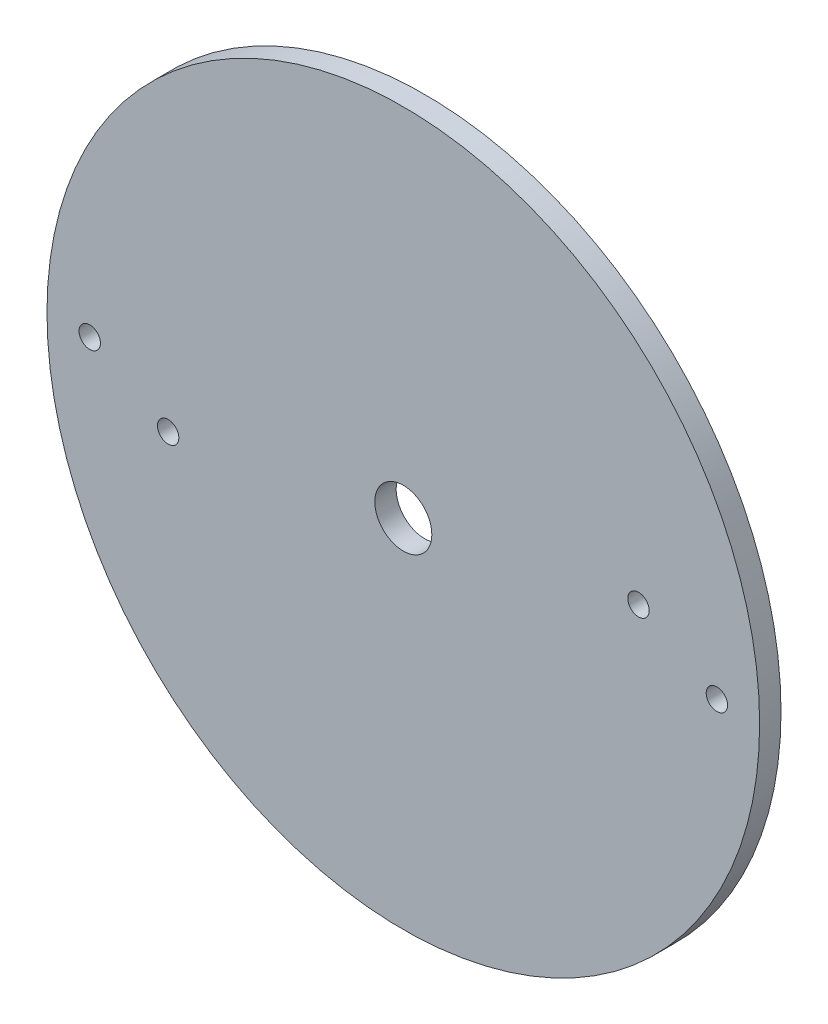
ISO-10303-21;
HEADER;
FILE_DESCRIPTION(('STEP AP214'),'2;1');
FILE_NAME('part.step','',(''),(''),'','','');
FILE_SCHEMA(('AUTOMOTIVE_DESIGN { 1 0 10303 214 1 1 1 1 }'));
ENDSEC;
DATA;
#1=APPLICATION_CONTEXT('core data for automotive mechanical design processes');
#2=APPLICATION_PROTOCOL_DEFINITION('international standard','automotive_design',2000,#1);
#3=PRODUCT_CONTEXT('',#1,'mechanical');
#4=PRODUCT('Part','Part','',(#3));
#5=PRODUCT_RELATED_PRODUCT_CATEGORY('part','',(#4));
#6=PRODUCT_DEFINITION_FORMATION('','',#4);
#7=PRODUCT_DEFINITION_CONTEXT('part definition',#1,'design');
#8=PRODUCT_DEFINITION('design','',#6,#7);
#9=PRODUCT_DEFINITION_SHAPE('','',#8);
#10=(LENGTH_UNIT() NAMED_UNIT(*) SI_UNIT(.MILLI.,.METRE.));
#11=(NAMED_UNIT(*) PLANE_ANGLE_UNIT() SI_UNIT($,.RADIAN.));
#12=(NAMED_UNIT(*) SI_UNIT($,.STERADIAN.) SOLID_ANGLE_UNIT());
#13=UNCERTAINTY_MEASURE_WITH_UNIT(LENGTH_MEASURE(1.E-05),#10,'distance_accuracy_value','');
#14=(GEOMETRIC_REPRESENTATION_CONTEXT(3) GLOBAL_UNCERTAINTY_ASSIGNED_CONTEXT((#13)) GLOBAL_UNIT_ASSIGNED_CONTEXT((#10,
#11,#12)) REPRESENTATION_CONTEXT('',''));
#15=CARTESIAN_POINT('',(0.,0.,0.));
#16=DIRECTION('',(0.,0.,1.));
#17=DIRECTION('',(1.,0.,0.));
#18=AXIS2_PLACEMENT_3D('',#15,#16,#17);
#19=CARTESIAN_POINT('',(0.,0.,3.));
#20=DIRECTION('',(0.,0.,-1.));
#21=DIRECTION('',(-1.,0.,0.));
#22=AXIS2_PLACEMENT_3D('',#19,#20,#21);
#23=CYLINDRICAL_SURFACE('',#22,50.);
#24=CARTESIAN_POINT('',(0.,0.,3.));
#25=DIRECTION('',(0.,0.,1.));
#26=DIRECTION('',(1.,0.,0.));
#27=AXIS2_PLACEMENT_3D('',#24,#25,#26);
#28=CIRCLE('',#27,50.);
#29=CARTESIAN_POINT('',(50.,0.,3.));
#30=VERTEX_POINT('',#29);
#31=EDGE_CURVE('E11',#30,#30,#28,.T.);
#32=ORIENTED_EDGE('',*,*,#31,.F.);
#33=EDGE_LOOP('',(#32));
#34=FACE_BOUND('',#33,.T.);
#35=CARTESIAN_POINT('',(0.,0.,0.));
#36=DIRECTION('',(0.,0.,1.));
#37=DIRECTION('',(1.,0.,0.));
#38=AXIS2_PLACEMENT_3D('',#35,#36,#37);
#39=CIRCLE('',#38,50.);
#40=CARTESIAN_POINT('',(50.,0.,0.));
#41=VERTEX_POINT('',#40);
#42=EDGE_CURVE('E40',#41,#41,#39,.T.);
#43=ORIENTED_EDGE('',*,*,#42,.T.);
#44=EDGE_LOOP('',(#43));
#45=FACE_BOUND('',#44,.T.);
#46=ADVANCED_FACE('F37',(#34,#45),#23,.T.);
#47=CARTESIAN_POINT('',(0.,0.,3.));
#48=DIRECTION('',(0.,0.,1.));
#49=DIRECTION('',(1.,0.,0.));
#50=AXIS2_PLACEMENT_3D('',#47,#48,#49);
#51=PLANE('',#50);
#52=CARTESIAN_POINT('',(32.9999999999999,6.00000000000049,3.));
#53=DIRECTION('',(0.,0.,1.));
#54=DIRECTION('',(-1.,0.,0.));
#55=AXIS2_PLACEMENT_3D('',#52,#53,#54);
#56=CIRCLE('',#55,1.5);
#57=CARTESIAN_POINT('',(31.4999999999999,6.00000000000047,3.));
#58=VERTEX_POINT('',#57);
#59=EDGE_CURVE('E75',#58,#58,#56,.T.);
#60=ORIENTED_EDGE('',*,*,#59,.F.);
#61=EDGE_LOOP('',(#60));
#62=FACE_BOUND('',#61,.T.);
#63=CARTESIAN_POINT('',(-33.,-6.,3.));
#64=DIRECTION('',(0.,0.,1.));
#65=DIRECTION('',(1.,0.,0.));
#66=AXIS2_PLACEMENT_3D('',#63,#64,#65);
#67=CIRCLE('',#66,1.5);
#68=CARTESIAN_POINT('',(-31.5,-6.,3.));
#69=VERTEX_POINT('',#68);
#70=EDGE_CURVE('E69',#69,#69,#67,.T.);
#71=ORIENTED_EDGE('',*,*,#70,.F.);
#72=EDGE_LOOP('',(#71));
#73=FACE_BOUND('',#72,.T.);
#74=CARTESIAN_POINT('',(44.,6.1988916155264E-13,3.));
#75=DIRECTION('',(0.,0.,1.));
#76=DIRECTION('',(-1.,0.,0.));
#77=AXIS2_PLACEMENT_3D('',#74,#75,#76);
#78=CIRCLE('',#77,1.5);
#79=CARTESIAN_POINT('',(42.5,5.98756576499709E-13,3.));
#80=VERTEX_POINT('',#79);
#81=EDGE_CURVE('E63',#80,#80,#78,.T.);
#82=ORIENTED_EDGE('',*,*,#81,.F.);
#83=EDGE_LOOP('',(#82));
#84=FACE_BOUND('',#83,.T.);
#85=CARTESIAN_POINT('',(-44.,0.,3.));
#86=DIRECTION('',(0.,0.,1.));
#87=DIRECTION('',(1.,0.,0.));
#88=AXIS2_PLACEMENT_3D('',#85,#86,#87);
#89=CIRCLE('',#88,1.5);
#90=CARTESIAN_POINT('',(-42.5,0.,3.));
#91=VERTEX_POINT('',#90);
#92=EDGE_CURVE('E57',#91,#91,#89,.T.);
#93=ORIENTED_EDGE('',*,*,#92,.F.);
#94=EDGE_LOOP('',(#93));
#95=FACE_BOUND('',#94,.T.);
#96=CARTESIAN_POINT('',(0.,0.,3.));
#97=DIRECTION('',(0.,0.,1.));
#98=DIRECTION('',(1.,0.,0.));
#99=AXIS2_PLACEMENT_3D('',#96,#97,#98);
#100=CIRCLE('',#99,4.);
#101=CARTESIAN_POINT('',(4.,0.,3.));
#102=VERTEX_POINT('',#101);
#103=EDGE_CURVE('E51',#102,#102,#100,.T.);
#104=ORIENTED_EDGE('',*,*,#103,.F.);
#105=EDGE_LOOP('',(#104));
#106=FACE_BOUND('',#105,.T.);
#107=ORIENTED_EDGE('',*,*,#31,.T.);
#108=EDGE_LOOP('',(#107));
#109=FACE_BOUND('',#108,.T.);
#110=ADVANCED_FACE('F81',(#62,#73,#84,#95,#106,#109),#51,.T.);
#111=CARTESIAN_POINT('',(0.,0.,0.));
#112=DIRECTION('',(0.,0.,1.));
#113=DIRECTION('',(1.,0.,0.));
#114=AXIS2_PLACEMENT_3D('',#111,#112,#113);
#115=PLANE('',#114);
#116=CARTESIAN_POINT('',(32.9999999999999,6.00000000000049,0.));
#117=DIRECTION('',(0.,0.,1.));
#118=DIRECTION('',(1.,0.,0.));
#119=AXIS2_PLACEMENT_3D('',#116,#117,#118);
#120=CIRCLE('',#119,1.5);
#121=CARTESIAN_POINT('',(34.4999999999999,6.00000000000049,0.));
#122=VERTEX_POINT('',#121);
#123=EDGE_CURVE('E72',#122,#122,#120,.F.);
#124=ORIENTED_EDGE('',*,*,#123,.F.);
#125=EDGE_LOOP('',(#124));
#126=FACE_BOUND('',#125,.T.);
#127=CARTESIAN_POINT('',(-33.,-6.,0.));
#128=DIRECTION('',(0.,0.,1.));
#129=DIRECTION('',(1.,0.,0.));
#130=AXIS2_PLACEMENT_3D('',#127,#128,#129);
#131=CIRCLE('',#130,1.5);
#132=CARTESIAN_POINT('',(-31.5,-6.,0.));
#133=VERTEX_POINT('',#132);
#134=EDGE_CURVE('E66',#133,#133,#131,.F.);
#135=ORIENTED_EDGE('',*,*,#134,.F.);
#136=EDGE_LOOP('',(#135));
#137=FACE_BOUND('',#136,.T.);
#138=CARTESIAN_POINT('',(44.,6.1988916155264E-13,0.));
#139=DIRECTION('',(0.,0.,1.));
#140=DIRECTION('',(1.,0.,0.));
#141=AXIS2_PLACEMENT_3D('',#138,#139,#140);
#142=CIRCLE('',#141,1.5);
#143=CARTESIAN_POINT('',(45.5,6.1988916155264E-13,0.));
#144=VERTEX_POINT('',#143);
#145=EDGE_CURVE('E60',#144,#144,#142,.F.);
#146=ORIENTED_EDGE('',*,*,#145,.F.);
#147=EDGE_LOOP('',(#146));
#148=FACE_BOUND('',#147,.T.);
#149=CARTESIAN_POINT('',(-44.,0.,0.));
#150=DIRECTION('',(0.,0.,1.));
#151=DIRECTION('',(1.,0.,0.));
#152=AXIS2_PLACEMENT_3D('',#149,#150,#151);
#153=CIRCLE('',#152,1.5);
#154=CARTESIAN_POINT('',(-42.5,0.,0.));
#155=VERTEX_POINT('',#154);
#156=EDGE_CURVE('E54',#155,#155,#153,.F.);
#157=ORIENTED_EDGE('',*,*,#156,.F.);
#158=EDGE_LOOP('',(#157));
#159=FACE_BOUND('',#158,.T.);
#160=CARTESIAN_POINT('',(0.,0.,0.));
#161=DIRECTION('',(0.,0.,1.));
#162=DIRECTION('',(1.,0.,0.));
#163=AXIS2_PLACEMENT_3D('',#160,#161,#162);
#164=CIRCLE('',#163,4.);
#165=CARTESIAN_POINT('',(4.,0.,0.));
#166=VERTEX_POINT('',#165);
#167=EDGE_CURVE('E47',#166,#166,#164,.F.);
#168=ORIENTED_EDGE('',*,*,#167,.F.);
#169=EDGE_LOOP('',(#168));
#170=FACE_BOUND('',#169,.T.);
#171=ORIENTED_EDGE('',*,*,#42,.F.);
#172=EDGE_LOOP('',(#171));
#173=FACE_BOUND('',#172,.T.);
#174=ADVANCED_FACE('F84',(#126,#137,#148,#159,#170,#173),#115,.F.);
#175=CARTESIAN_POINT('',(0.,0.,-11.3137084989848));
#176=DIRECTION('',(0.,0.,1.));
#177=DIRECTION('',(1.,0.,0.));
#178=AXIS2_PLACEMENT_3D('',#175,#176,#177);
#179=CYLINDRICAL_SURFACE('',#178,4.);
#180=ORIENTED_EDGE('',*,*,#167,.T.);
#181=EDGE_LOOP('',(#180));
#182=FACE_BOUND('',#181,.T.);
#183=ORIENTED_EDGE('',*,*,#103,.T.);
#184=EDGE_LOOP('',(#183));
#185=FACE_BOUND('',#184,.T.);
#186=ADVANCED_FACE('F94',(#182,#185),#179,.F.);
#187=CARTESIAN_POINT('',(-44.,0.,-4.24264068711927));
#188=DIRECTION('',(0.,0.,1.));
#189=DIRECTION('',(1.,0.,0.));
#190=AXIS2_PLACEMENT_3D('',#187,#188,#189);
#191=CYLINDRICAL_SURFACE('',#190,1.5);
#192=ORIENTED_EDGE('',*,*,#156,.T.);
#193=EDGE_LOOP('',(#192));
#194=FACE_BOUND('',#193,.T.);
#195=ORIENTED_EDGE('',*,*,#92,.T.);
#196=EDGE_LOOP('',(#195));
#197=FACE_BOUND('',#196,.T.);
#198=ADVANCED_FACE('F96',(#194,#197),#191,.F.);
#199=CARTESIAN_POINT('',(44.,6.1988916155264E-13,-4.24264068711927));
#200=DIRECTION('',(0.,0.,1.));
#201=DIRECTION('',(1.,0.,0.));
#202=AXIS2_PLACEMENT_3D('',#199,#200,#201);
#203=CYLINDRICAL_SURFACE('',#202,1.5);
#204=ORIENTED_EDGE('',*,*,#145,.T.);
#205=EDGE_LOOP('',(#204));
#206=FACE_BOUND('',#205,.T.);
#207=ORIENTED_EDGE('',*,*,#81,.T.);
#208=EDGE_LOOP('',(#207));
#209=FACE_BOUND('',#208,.T.);
#210=ADVANCED_FACE('F103',(#206,#209),#203,.F.);
#211=CARTESIAN_POINT('',(-33.,-6.,-4.24264068711929));
#212=DIRECTION('',(0.,0.,1.));
#213=DIRECTION('',(1.,0.,0.));
#214=AXIS2_PLACEMENT_3D('',#211,#212,#213);
#215=CYLINDRICAL_SURFACE('',#214,1.5);
#216=ORIENTED_EDGE('',*,*,#134,.T.);
#217=EDGE_LOOP('',(#216));
#218=FACE_BOUND('',#217,.T.);
#219=ORIENTED_EDGE('',*,*,#70,.T.);
#220=EDGE_LOOP('',(#219));
#221=FACE_BOUND('',#220,.T.);
#222=ADVANCED_FACE('F132',(#218,#221),#215,.F.);
#223=CARTESIAN_POINT('',(32.9999999999999,6.00000000000049,-4.24264068711929));
#224=DIRECTION('',(0.,0.,1.));
#225=DIRECTION('',(1.,0.,0.));
#226=AXIS2_PLACEMENT_3D('',#223,#224,#225);
#227=CYLINDRICAL_SURFACE('',#226,1.5);
#228=ORIENTED_EDGE('',*,*,#123,.T.);
#229=EDGE_LOOP('',(#228));
#230=FACE_BOUND('',#229,.T.);
#231=ORIENTED_EDGE('',*,*,#59,.T.);
#232=EDGE_LOOP('',(#231));
#233=FACE_BOUND('',#232,.T.);
#234=ADVANCED_FACE('F79',(#230,#233),#227,.F.);
#235=CLOSED_SHELL('',(#46,#110,#174,#186,#198,#210,#222,#234));
#236=MANIFOLD_SOLID_BREP('B2',#235);
#237=ADVANCED_BREP_SHAPE_REPRESENTATION('',(#18,#236),#14);
#238=SHAPE_DEFINITION_REPRESENTATION(#9,#237);
ENDSEC;
END-ISO-10303-21;
